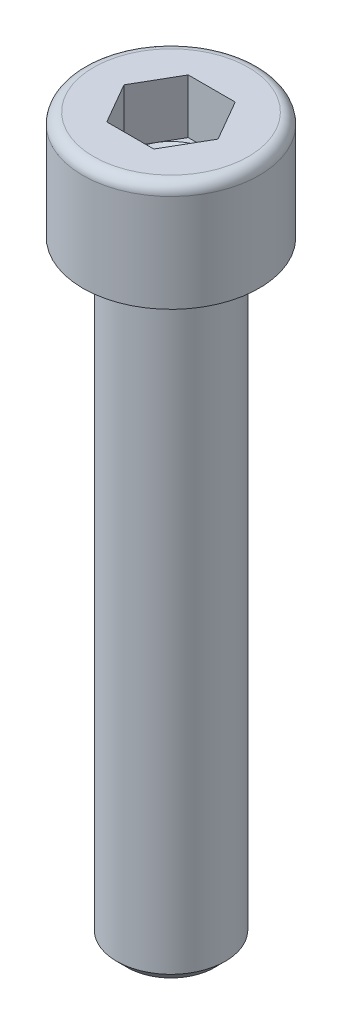
ISO-10303-21;
HEADER;
FILE_DESCRIPTION(('STEP AP214'),'2;1');
FILE_NAME('part.step','',(''),(''),'','','');
FILE_SCHEMA(('AUTOMOTIVE_DESIGN { 1 0 10303 214 1 1 1 1 }'));
ENDSEC;
DATA;
#1=APPLICATION_CONTEXT('core data for automotive mechanical design processes');
#2=APPLICATION_PROTOCOL_DEFINITION('international standard','automotive_design',2000,#1);
#3=PRODUCT_CONTEXT('',#1,'mechanical');
#4=PRODUCT('Part','Part','',(#3));
#5=PRODUCT_RELATED_PRODUCT_CATEGORY('part','',(#4));
#6=PRODUCT_DEFINITION_FORMATION('','',#4);
#7=PRODUCT_DEFINITION_CONTEXT('part definition',#1,'design');
#8=PRODUCT_DEFINITION('design','',#6,#7);
#9=PRODUCT_DEFINITION_SHAPE('','',#8);
#10=(LENGTH_UNIT() NAMED_UNIT(*) SI_UNIT(.MILLI.,.METRE.));
#11=(NAMED_UNIT(*) PLANE_ANGLE_UNIT() SI_UNIT($,.RADIAN.));
#12=(NAMED_UNIT(*) SI_UNIT($,.STERADIAN.) SOLID_ANGLE_UNIT());
#13=UNCERTAINTY_MEASURE_WITH_UNIT(LENGTH_MEASURE(1.E-05),#10,'distance_accuracy_value','');
#14=(GEOMETRIC_REPRESENTATION_CONTEXT(3) GLOBAL_UNCERTAINTY_ASSIGNED_CONTEXT((#13)) GLOBAL_UNIT_ASSIGNED_CONTEXT((#10,
#11,#12)) REPRESENTATION_CONTEXT('',''));
#15=CARTESIAN_POINT('',(0.,0.,0.));
#16=DIRECTION('',(0.,0.,1.));
#17=DIRECTION('',(1.,0.,0.));
#18=AXIS2_PLACEMENT_3D('',#15,#16,#17);
#19=CARTESIAN_POINT('',(0.,-45.,0.));
#20=DIRECTION('',(0.,1.,0.));
#21=DIRECTION('',(0.,0.,1.));
#22=AXIS2_PLACEMENT_3D('',#19,#20,#21);
#23=CYLINDRICAL_SURFACE('',#22,4.);
#24=CARTESIAN_POINT('',(0.,-44.2,0.));
#25=DIRECTION('',(0.,1.,0.));
#26=DIRECTION('',(0.,0.,1.));
#27=AXIS2_PLACEMENT_3D('',#24,#25,#26);
#28=CIRCLE('',#27,4.);
#29=CARTESIAN_POINT('',(0.,-44.2,4.));
#30=VERTEX_POINT('',#29);
#31=EDGE_CURVE('E29',#30,#30,#28,.T.);
#32=ORIENTED_EDGE('',*,*,#31,.T.);
#33=EDGE_LOOP('',(#32));
#34=FACE_BOUND('',#33,.T.);
#35=CARTESIAN_POINT('',(0.,0.,0.));
#36=DIRECTION('',(0.,1.,0.));
#37=DIRECTION('',(0.,0.,1.));
#38=AXIS2_PLACEMENT_3D('',#35,#36,#37);
#39=CIRCLE('',#38,4.);
#40=CARTESIAN_POINT('',(0.,0.,4.));
#41=VERTEX_POINT('',#40);
#42=EDGE_CURVE('E140',#41,#41,#39,.T.);
#43=ORIENTED_EDGE('',*,*,#42,.F.);
#44=EDGE_LOOP('',(#43));
#45=FACE_BOUND('',#44,.T.);
#46=ADVANCED_FACE('F22',(#34,#45),#23,.T.);
#47=CARTESIAN_POINT('',(0.,-45.,0.));
#48=DIRECTION('',(0.,1.,0.));
#49=DIRECTION('',(0.,0.,1.));
#50=AXIS2_PLACEMENT_3D('',#47,#48,#49);
#51=PLANE('',#50);
#52=CARTESIAN_POINT('',(0.,-45.,0.));
#53=DIRECTION('',(0.,1.,0.));
#54=DIRECTION('',(0.,0.,1.));
#55=AXIS2_PLACEMENT_3D('',#52,#53,#54);
#56=CIRCLE('',#55,3.19999999999999);
#57=CARTESIAN_POINT('',(0.,-45.,3.19999999999999));
#58=VERTEX_POINT('',#57);
#59=EDGE_CURVE('E11',#58,#58,#56,.F.);
#60=ORIENTED_EDGE('',*,*,#59,.T.);
#61=EDGE_LOOP('',(#60));
#62=FACE_BOUND('',#61,.T.);
#63=ADVANCED_FACE('F150',(#62),#51,.F.);
#64=CARTESIAN_POINT('',(0.,-44.2,0.));
#65=DIRECTION('',(0.,1.,0.));
#66=DIRECTION('',(0.,0.,1.));
#67=AXIS2_PLACEMENT_3D('',#64,#65,#66);
#68=CONICAL_SURFACE('',#67,4.,0.785398163397442);
#69=ORIENTED_EDGE('',*,*,#59,.F.);
#70=EDGE_LOOP('',(#69));
#71=FACE_BOUND('',#70,.T.);
#72=ORIENTED_EDGE('',*,*,#31,.F.);
#73=EDGE_LOOP('',(#72));
#74=FACE_BOUND('',#73,.T.);
#75=ADVANCED_FACE('F147',(#71,#74),#68,.T.);
#76=CARTESIAN_POINT('',(0.,0.,0.));
#77=DIRECTION('',(0.,1.,0.));
#78=DIRECTION('',(0.,0.,1.));
#79=AXIS2_PLACEMENT_3D('',#76,#77,#78);
#80=PLANE('',#79);
#81=ORIENTED_EDGE('',*,*,#42,.T.);
#82=EDGE_LOOP('',(#81));
#83=FACE_BOUND('',#82,.T.);
#84=CARTESIAN_POINT('',(0.,0.,0.));
#85=DIRECTION('',(0.,1.,0.));
#86=DIRECTION('',(0.,0.,1.));
#87=AXIS2_PLACEMENT_3D('',#84,#85,#86);
#88=CIRCLE('',#87,6.5);
#89=CARTESIAN_POINT('',(0.,0.,6.5));
#90=VERTEX_POINT('',#89);
#91=EDGE_CURVE('E137',#90,#90,#88,.T.);
#92=ORIENTED_EDGE('',*,*,#91,.F.);
#93=EDGE_LOOP('',(#92));
#94=FACE_BOUND('',#93,.T.);
#95=ADVANCED_FACE('F149',(#83,#94),#80,.F.);
#96=CARTESIAN_POINT('',(0.,8.00000000000001,0.));
#97=DIRECTION('',(0.,1.,0.));
#98=DIRECTION('',(0.,0.,1.));
#99=AXIS2_PLACEMENT_3D('',#96,#97,#98);
#100=CYLINDRICAL_SURFACE('',#99,6.5);
#101=CARTESIAN_POINT('',(0.,7.20000000000001,0.));
#102=DIRECTION('',(0.,1.,0.));
#103=DIRECTION('',(0.,0.,1.));
#104=AXIS2_PLACEMENT_3D('',#101,#102,#103);
#105=CIRCLE('',#104,6.5);
#106=CARTESIAN_POINT('',(0.,7.20000000000001,6.5));
#107=VERTEX_POINT('',#106);
#108=EDGE_CURVE('E134',#107,#107,#105,.T.);
#109=ORIENTED_EDGE('',*,*,#108,.F.);
#110=EDGE_LOOP('',(#109));
#111=FACE_BOUND('',#110,.T.);
#112=ORIENTED_EDGE('',*,*,#91,.T.);
#113=EDGE_LOOP('',(#112));
#114=FACE_BOUND('',#113,.T.);
#115=ADVANCED_FACE('F157',(#111,#114),#100,.T.);
#116=CARTESIAN_POINT('',(0.,7.20000000000001,0.));
#117=DIRECTION('',(0.,1.,0.));
#118=DIRECTION('',(0.,0.,1.));
#119=AXIS2_PLACEMENT_3D('',#116,#117,#118);
#120=TOROIDAL_SURFACE('',#119,5.7,0.8);
#121=CARTESIAN_POINT('',(0.,8.00000000000001,0.));
#122=DIRECTION('',(0.,1.,0.));
#123=DIRECTION('',(0.,0.,1.));
#124=AXIS2_PLACEMENT_3D('',#121,#122,#123);
#125=CIRCLE('',#124,5.7);
#126=CARTESIAN_POINT('',(0.,8.00000000000001,5.7));
#127=VERTEX_POINT('',#126);
#128=EDGE_CURVE('E129',#127,#127,#125,.T.);
#129=ORIENTED_EDGE('',*,*,#128,.F.);
#130=EDGE_LOOP('',(#129));
#131=FACE_BOUND('',#130,.T.);
#132=ORIENTED_EDGE('',*,*,#108,.T.);
#133=EDGE_LOOP('',(#132));
#134=FACE_BOUND('',#133,.T.);
#135=ADVANCED_FACE('F170',(#131,#134),#120,.T.);
#136=CARTESIAN_POINT('',(3.,8.00000000000001,0.));
#137=DIRECTION('',(0.,-1.,0.));
#138=DIRECTION('',(0.,0.,-1.));
#139=AXIS2_PLACEMENT_3D('',#136,#137,#138);
#140=PLANE('',#139);
#141=DIRECTION('',(-1.,0.,0.));
#142=VECTOR('',#141,1.);
#143=CARTESIAN_POINT('',(-1.73205080756889,8.00000000000001,-3.));
#144=LINE('',#143,#142);
#145=CARTESIAN_POINT('',(1.73205080756889,8.00000000000001,-3.));
#146=VERTEX_POINT('',#145);
#147=CARTESIAN_POINT('',(-1.73205080756889,8.00000000000001,-3.));
#148=VERTEX_POINT('',#147);
#149=EDGE_CURVE('E36',#146,#148,#144,.T.);
#150=ORIENTED_EDGE('',*,*,#149,.F.);
#151=DIRECTION('',(-0.499999999999998,0.,-0.86602540378444));
#152=VECTOR('',#151,1.);
#153=CARTESIAN_POINT('',(1.73205080756889,8.00000000000001,-3.));
#154=LINE('',#153,#152);
#155=CARTESIAN_POINT('',(3.46410161513774,8.00000000000001,0.));
#156=VERTEX_POINT('',#155);
#157=EDGE_CURVE('E113',#156,#146,#154,.T.);
#158=ORIENTED_EDGE('',*,*,#157,.F.);
#159=DIRECTION('',(0.499999999999997,0.,-0.86602540378444));
#160=VECTOR('',#159,1.);
#161=CARTESIAN_POINT('',(1.73205080756889,8.00000000000001,3.));
#162=LINE('',#161,#160);
#163=CARTESIAN_POINT('',(1.73205080756889,8.00000000000001,3.));
#164=VERTEX_POINT('',#163);
#165=EDGE_CURVE('E250',#164,#156,#162,.T.);
#166=ORIENTED_EDGE('',*,*,#165,.F.);
#167=DIRECTION('',(1.,0.,0.));
#168=VECTOR('',#167,1.);
#169=CARTESIAN_POINT('',(-1.73205080756888,8.00000000000001,3.));
#170=LINE('',#169,#168);
#171=CARTESIAN_POINT('',(-1.73205080756888,8.00000000000001,3.));
#172=VERTEX_POINT('',#171);
#173=EDGE_CURVE('E248',#172,#164,#170,.T.);
#174=ORIENTED_EDGE('',*,*,#173,.F.);
#175=DIRECTION('',(0.499999999999998,0.,0.86602540378444));
#176=VECTOR('',#175,1.);
#177=CARTESIAN_POINT('',(-1.73205080756888,8.00000000000001,3.));
#178=LINE('',#177,#176);
#179=CARTESIAN_POINT('',(-3.46410161513774,8.00000000000001,0.));
#180=VERTEX_POINT('',#179);
#181=EDGE_CURVE('E97',#180,#172,#178,.T.);
#182=ORIENTED_EDGE('',*,*,#181,.F.);
#183=DIRECTION('',(-0.499999999999998,0.,0.86602540378444));
#184=VECTOR('',#183,1.);
#185=CARTESIAN_POINT('',(-1.73205080756889,8.00000000000001,-3.));
#186=LINE('',#185,#184);
#187=EDGE_CURVE('E93',#148,#180,#186,.T.);
#188=ORIENTED_EDGE('',*,*,#187,.F.);
#189=EDGE_LOOP('',(#150,#158,#166,#174,#182,#188));
#190=FACE_BOUND('',#189,.T.);
#191=ORIENTED_EDGE('',*,*,#128,.T.);
#192=EDGE_LOOP('',(#191));
#193=FACE_BOUND('',#192,.T.);
#194=ADVANCED_FACE('F94',(#190,#193),#140,.F.);
#195=CARTESIAN_POINT('',(1.73205080756889,4.,-3.));
#196=DIRECTION('',(0.86602540378444,0.,-0.499999999999998));
#197=DIRECTION('',(-0.499999999999998,0.,-0.86602540378444));
#198=AXIS2_PLACEMENT_3D('',#195,#196,#197);
#199=PLANE('',#198);
#200=ORIENTED_EDGE('',*,*,#157,.T.);
#201=DIRECTION('',(0.,1.,0.));
#202=VECTOR('',#201,1.);
#203=CARTESIAN_POINT('',(1.73205080756889,4.,-3.));
#204=LINE('',#203,#202);
#205=CARTESIAN_POINT('',(1.73205080756889,4.,-3.));
#206=VERTEX_POINT('',#205);
#207=EDGE_CURVE('E111',#206,#146,#204,.T.);
#208=ORIENTED_EDGE('',*,*,#207,.F.);
#209=DIRECTION('',(-0.499999999999998,0.,-0.86602540378444));
#210=VECTOR('',#209,1.);
#211=CARTESIAN_POINT('',(1.73205080756889,4.,-3.));
#212=LINE('',#211,#210);
#213=CARTESIAN_POINT('',(2.59807621135331,4.,-1.49999999999999));
#214=VERTEX_POINT('',#213);
#215=EDGE_CURVE('E252',#214,#206,#212,.T.);
#216=ORIENTED_EDGE('',*,*,#215,.F.);
#217=CARTESIAN_POINT('',(3.46410161513774,4.,0.));
#218=VERTEX_POINT('',#217);
#219=EDGE_CURVE('E256',#218,#214,#212,.T.);
#220=ORIENTED_EDGE('',*,*,#219,.F.);
#221=DIRECTION('',(0.,1.,0.));
#222=VECTOR('',#221,1.);
#223=CARTESIAN_POINT('',(3.46410161513774,4.,0.));
#224=LINE('',#223,#222);
#225=EDGE_CURVE('E240',#218,#156,#224,.T.);
#226=ORIENTED_EDGE('',*,*,#225,.T.);
#227=EDGE_LOOP('',(#200,#208,#216,#220,#226));
#228=FACE_BOUND('',#227,.T.);
#229=ADVANCED_FACE('F177',(#228),#199,.F.);
#230=CARTESIAN_POINT('',(1.73205080756889,4.,3.));
#231=DIRECTION('',(0.86602540378444,0.,0.499999999999997));
#232=DIRECTION('',(0.499999999999997,0.,-0.86602540378444));
#233=AXIS2_PLACEMENT_3D('',#230,#231,#232);
#234=PLANE('',#233);
#235=ORIENTED_EDGE('',*,*,#165,.T.);
#236=ORIENTED_EDGE('',*,*,#225,.F.);
#237=DIRECTION('',(0.499999999999997,0.,-0.86602540378444));
#238=VECTOR('',#237,1.);
#239=CARTESIAN_POINT('',(1.73205080756889,4.,3.));
#240=LINE('',#239,#238);
#241=CARTESIAN_POINT('',(2.59807621135332,4.,1.49999999999999));
#242=VERTEX_POINT('',#241);
#243=EDGE_CURVE('E236',#242,#218,#240,.T.);
#244=ORIENTED_EDGE('',*,*,#243,.F.);
#245=CARTESIAN_POINT('',(1.73205080756889,4.,3.));
#246=VERTEX_POINT('',#245);
#247=EDGE_CURVE('E44',#246,#242,#240,.T.);
#248=ORIENTED_EDGE('',*,*,#247,.F.);
#249=DIRECTION('',(0.,1.,0.));
#250=VECTOR('',#249,1.);
#251=CARTESIAN_POINT('',(1.73205080756889,4.,3.));
#252=LINE('',#251,#250);
#253=EDGE_CURVE('E230',#246,#164,#252,.T.);
#254=ORIENTED_EDGE('',*,*,#253,.T.);
#255=EDGE_LOOP('',(#235,#236,#244,#248,#254));
#256=FACE_BOUND('',#255,.T.);
#257=ADVANCED_FACE('F185',(#256),#234,.F.);
#258=CARTESIAN_POINT('',(-1.73205080756888,4.,3.));
#259=DIRECTION('',(0.,0.,1.));
#260=DIRECTION('',(1.,0.,0.));
#261=AXIS2_PLACEMENT_3D('',#258,#259,#260);
#262=PLANE('',#261);
#263=ORIENTED_EDGE('',*,*,#173,.T.);
#264=ORIENTED_EDGE('',*,*,#253,.F.);
#265=DIRECTION('',(1.,0.,0.));
#266=VECTOR('',#265,1.);
#267=CARTESIAN_POINT('',(-1.73205080756888,4.,3.));
#268=LINE('',#267,#266);
#269=CARTESIAN_POINT('',(0.,4.,3.));
#270=VERTEX_POINT('',#269);
#271=EDGE_CURVE('E219',#270,#246,#268,.T.);
#272=ORIENTED_EDGE('',*,*,#271,.F.);
#273=CARTESIAN_POINT('',(-1.73205080756888,4.,3.));
#274=VERTEX_POINT('',#273);
#275=EDGE_CURVE('E228',#274,#270,#268,.T.);
#276=ORIENTED_EDGE('',*,*,#275,.F.);
#277=DIRECTION('',(0.,1.,0.));
#278=VECTOR('',#277,1.);
#279=CARTESIAN_POINT('',(-1.73205080756888,4.,3.));
#280=LINE('',#279,#278);
#281=EDGE_CURVE('E121',#274,#172,#280,.T.);
#282=ORIENTED_EDGE('',*,*,#281,.T.);
#283=EDGE_LOOP('',(#263,#264,#272,#276,#282));
#284=FACE_BOUND('',#283,.T.);
#285=ADVANCED_FACE('F195',(#284),#262,.F.);
#286=CARTESIAN_POINT('',(-1.73205080756888,4.,3.));
#287=DIRECTION('',(-0.86602540378444,0.,0.499999999999998));
#288=DIRECTION('',(0.499999999999998,0.,0.86602540378444));
#289=AXIS2_PLACEMENT_3D('',#286,#287,#288);
#290=PLANE('',#289);
#291=ORIENTED_EDGE('',*,*,#181,.T.);
#292=ORIENTED_EDGE('',*,*,#281,.F.);
#293=DIRECTION('',(0.499999999999998,0.,0.86602540378444));
#294=VECTOR('',#293,1.);
#295=CARTESIAN_POINT('',(-1.73205080756888,4.,3.));
#296=LINE('',#295,#294);
#297=CARTESIAN_POINT('',(-2.59807621135331,4.,1.49999999999999));
#298=VERTEX_POINT('',#297);
#299=EDGE_CURVE('E234',#298,#274,#296,.T.);
#300=ORIENTED_EDGE('',*,*,#299,.F.);
#301=CARTESIAN_POINT('',(-3.46410161513774,4.,0.));
#302=VERTEX_POINT('',#301);
#303=EDGE_CURVE('E231',#302,#298,#296,.T.);
#304=ORIENTED_EDGE('',*,*,#303,.F.);
#305=DIRECTION('',(0.,1.,0.));
#306=VECTOR('',#305,1.);
#307=CARTESIAN_POINT('',(-3.46410161513774,4.,0.));
#308=LINE('',#307,#306);
#309=EDGE_CURVE('E119',#302,#180,#308,.T.);
#310=ORIENTED_EDGE('',*,*,#309,.T.);
#311=EDGE_LOOP('',(#291,#292,#300,#304,#310));
#312=FACE_BOUND('',#311,.T.);
#313=ADVANCED_FACE('F192',(#312),#290,.F.);
#314=CARTESIAN_POINT('',(-1.73205080756889,4.,-3.));
#315=DIRECTION('',(-0.86602540378444,0.,-0.499999999999998));
#316=DIRECTION('',(-0.499999999999998,0.,0.86602540378444));
#317=AXIS2_PLACEMENT_3D('',#314,#315,#316);
#318=PLANE('',#317);
#319=ORIENTED_EDGE('',*,*,#187,.T.);
#320=ORIENTED_EDGE('',*,*,#309,.F.);
#321=DIRECTION('',(-0.499999999999998,0.,0.86602540378444));
#322=VECTOR('',#321,1.);
#323=CARTESIAN_POINT('',(-1.73205080756889,4.,-3.));
#324=LINE('',#323,#322);
#325=CARTESIAN_POINT('',(-2.59807621135331,4.,-1.49999999999999));
#326=VERTEX_POINT('',#325);
#327=EDGE_CURVE('E263',#326,#302,#324,.T.);
#328=ORIENTED_EDGE('',*,*,#327,.F.);
#329=CARTESIAN_POINT('',(-1.73205080756889,4.,-3.));
#330=VERTEX_POINT('',#329);
#331=EDGE_CURVE('E118',#330,#326,#324,.T.);
#332=ORIENTED_EDGE('',*,*,#331,.F.);
#333=DIRECTION('',(0.,1.,0.));
#334=VECTOR('',#333,1.);
#335=CARTESIAN_POINT('',(-1.73205080756889,4.,-3.));
#336=LINE('',#335,#334);
#337=EDGE_CURVE('E107',#330,#148,#336,.T.);
#338=ORIENTED_EDGE('',*,*,#337,.T.);
#339=EDGE_LOOP('',(#319,#320,#328,#332,#338));
#340=FACE_BOUND('',#339,.T.);
#341=ADVANCED_FACE('F115',(#340),#318,.F.);
#342=CARTESIAN_POINT('',(-1.73205080756889,4.,-3.));
#343=DIRECTION('',(0.,0.,-1.));
#344=DIRECTION('',(-1.,0.,0.));
#345=AXIS2_PLACEMENT_3D('',#342,#343,#344);
#346=PLANE('',#345);
#347=ORIENTED_EDGE('',*,*,#149,.T.);
#348=ORIENTED_EDGE('',*,*,#337,.F.);
#349=DIRECTION('',(-1.,0.,0.));
#350=VECTOR('',#349,1.);
#351=CARTESIAN_POINT('',(-1.73205080756889,4.,-3.));
#352=LINE('',#351,#350);
#353=CARTESIAN_POINT('',(0.,4.,-3.));
#354=VERTEX_POINT('',#353);
#355=EDGE_CURVE('E259',#354,#330,#352,.T.);
#356=ORIENTED_EDGE('',*,*,#355,.F.);
#357=EDGE_CURVE('E260',#206,#354,#352,.T.);
#358=ORIENTED_EDGE('',*,*,#357,.F.);
#359=ORIENTED_EDGE('',*,*,#207,.T.);
#360=EDGE_LOOP('',(#347,#348,#356,#358,#359));
#361=FACE_BOUND('',#360,.T.);
#362=ADVANCED_FACE('F105',(#361),#346,.F.);
#363=CARTESIAN_POINT('',(5.19615242270662,4.,3.));
#364=DIRECTION('',(0.,1.,0.));
#365=DIRECTION('',(0.,0.,1.));
#366=AXIS2_PLACEMENT_3D('',#363,#364,#365);
#367=PLANE('',#366);
#368=CARTESIAN_POINT('',(0.,4.,0.));
#369=DIRECTION('',(0.,1.,0.));
#370=DIRECTION('',(0.,0.,1.));
#371=AXIS2_PLACEMENT_3D('',#368,#369,#370);
#372=CIRCLE('',#371,3.);
#373=EDGE_CURVE('E131',#298,#270,#372,.T.);
#374=ORIENTED_EDGE('',*,*,#373,.F.);
#375=ORIENTED_EDGE('',*,*,#299,.T.);
#376=ORIENTED_EDGE('',*,*,#275,.T.);
#377=EDGE_LOOP('',(#374,#375,#376));
#378=FACE_BOUND('',#377,.T.);
#379=ADVANCED_FACE('F189',(#378),#367,.T.);
#380=EDGE_CURVE('E239',#326,#298,#372,.T.);
#381=ORIENTED_EDGE('',*,*,#380,.F.);
#382=ORIENTED_EDGE('',*,*,#327,.T.);
#383=ORIENTED_EDGE('',*,*,#303,.T.);
#384=EDGE_LOOP('',(#381,#382,#383));
#385=FACE_BOUND('',#384,.T.);
#386=ADVANCED_FACE('F204',(#385),#367,.T.);
#387=EDGE_CURVE('E241',#354,#326,#372,.T.);
#388=ORIENTED_EDGE('',*,*,#387,.F.);
#389=ORIENTED_EDGE('',*,*,#355,.T.);
#390=ORIENTED_EDGE('',*,*,#331,.T.);
#391=EDGE_LOOP('',(#388,#389,#390));
#392=FACE_BOUND('',#391,.T.);
#393=ADVANCED_FACE('F209',(#392),#367,.T.);
#394=EDGE_CURVE('E269',#214,#354,#372,.T.);
#395=ORIENTED_EDGE('',*,*,#394,.F.);
#396=ORIENTED_EDGE('',*,*,#215,.T.);
#397=ORIENTED_EDGE('',*,*,#357,.T.);
#398=EDGE_LOOP('',(#395,#396,#397));
#399=FACE_BOUND('',#398,.T.);
#400=ADVANCED_FACE('F216',(#399),#367,.T.);
#401=EDGE_CURVE('E130',#242,#214,#372,.T.);
#402=ORIENTED_EDGE('',*,*,#401,.F.);
#403=ORIENTED_EDGE('',*,*,#243,.T.);
#404=ORIENTED_EDGE('',*,*,#219,.T.);
#405=EDGE_LOOP('',(#402,#403,#404));
#406=FACE_BOUND('',#405,.T.);
#407=ADVANCED_FACE('F212',(#406),#367,.T.);
#408=EDGE_CURVE('E126',#270,#242,#372,.T.);
#409=ORIENTED_EDGE('',*,*,#408,.F.);
#410=ORIENTED_EDGE('',*,*,#271,.T.);
#411=ORIENTED_EDGE('',*,*,#247,.T.);
#412=EDGE_LOOP('',(#409,#410,#411));
#413=FACE_BOUND('',#412,.T.);
#414=ADVANCED_FACE('F181',(#413),#367,.T.);
#415=CARTESIAN_POINT('',(0.,4.,0.));
#416=DIRECTION('',(0.,1.,0.));
#417=DIRECTION('',(0.,0.,1.));
#418=AXIS2_PLACEMENT_3D('',#415,#416,#417);
#419=CONICAL_SURFACE('',#418,3.,1.04719755119659);
#420=CARTESIAN_POINT('',(0.,2.26794919243109,0.));
#421=VERTEX_POINT('',#420);
#422=VERTEX_LOOP('',#421);
#423=FACE_BOUND('',#422,.T.);
#424=ORIENTED_EDGE('',*,*,#408,.T.);
#425=ORIENTED_EDGE('',*,*,#401,.T.);
#426=ORIENTED_EDGE('',*,*,#394,.T.);
#427=ORIENTED_EDGE('',*,*,#387,.T.);
#428=ORIENTED_EDGE('',*,*,#380,.T.);
#429=ORIENTED_EDGE('',*,*,#373,.T.);
#430=EDGE_LOOP('',(#424,#425,#426,#427,#428,#429));
#431=FACE_BOUND('',#430,.T.);
#432=ADVANCED_FACE('F178',(#423,#431),#419,.F.);
#433=CLOSED_SHELL('',(#46,#63,#75,#95,#115,#135,#194,#229,#257,#285,#313,#341,#362,#379,#386,
#393,#400,#407,#414,#432));
#434=MANIFOLD_SOLID_BREP('B2',#433);
#435=ADVANCED_BREP_SHAPE_REPRESENTATION('',(#18,#434),#14);
#436=SHAPE_DEFINITION_REPRESENTATION(#9,#435);
ENDSEC;
END-ISO-10303-21;
